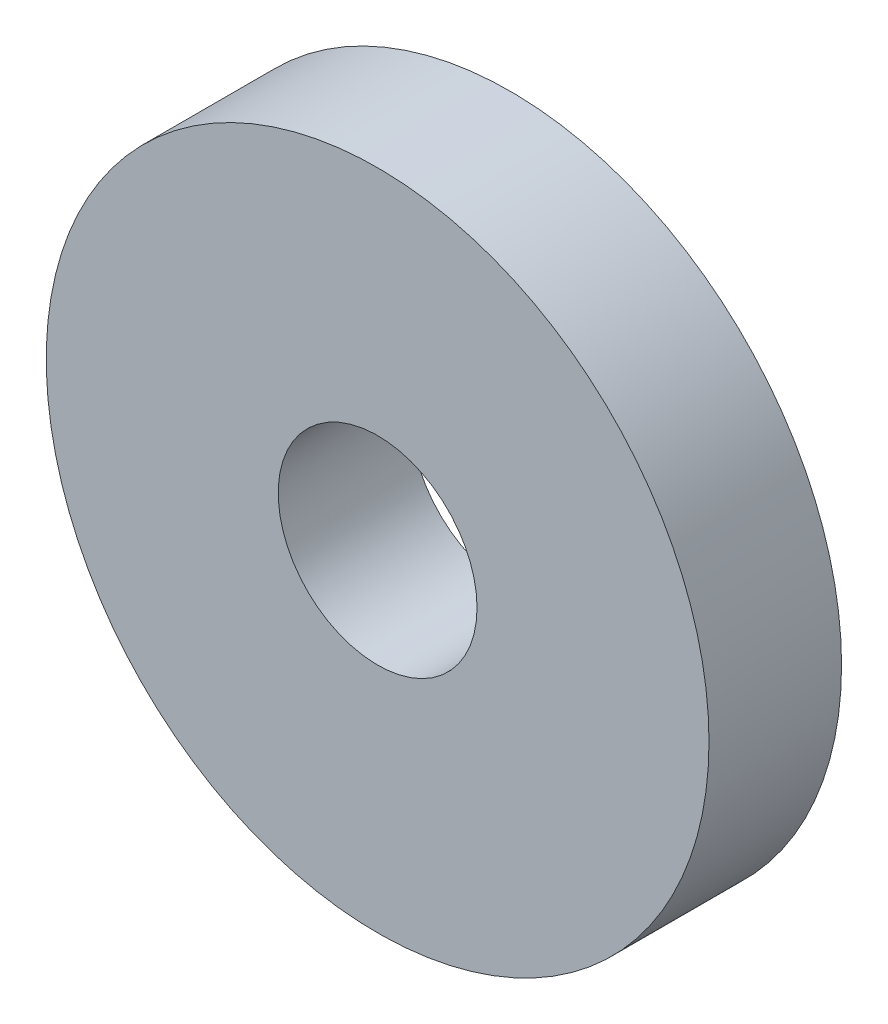
ISO-10303-21;
HEADER;
FILE_DESCRIPTION(('STEP AP214'),'2;1');
FILE_NAME('part.step','',(''),(''),'','','');
FILE_SCHEMA(('AUTOMOTIVE_DESIGN { 1 0 10303 214 1 1 1 1 }'));
ENDSEC;
DATA;
#1=APPLICATION_CONTEXT('core data for automotive mechanical design processes');
#2=APPLICATION_PROTOCOL_DEFINITION('international standard','automotive_design',2000,#1);
#3=PRODUCT_CONTEXT('',#1,'mechanical');
#4=PRODUCT('Part','Part','',(#3));
#5=PRODUCT_RELATED_PRODUCT_CATEGORY('part','',(#4));
#6=PRODUCT_DEFINITION_FORMATION('','',#4);
#7=PRODUCT_DEFINITION_CONTEXT('part definition',#1,'design');
#8=PRODUCT_DEFINITION('design','',#6,#7);
#9=PRODUCT_DEFINITION_SHAPE('','',#8);
#10=(LENGTH_UNIT() NAMED_UNIT(*) SI_UNIT(.MILLI.,.METRE.));
#11=(NAMED_UNIT(*) PLANE_ANGLE_UNIT() SI_UNIT($,.RADIAN.));
#12=(NAMED_UNIT(*) SI_UNIT($,.STERADIAN.) SOLID_ANGLE_UNIT());
#13=UNCERTAINTY_MEASURE_WITH_UNIT(LENGTH_MEASURE(1.E-05),#10,'distance_accuracy_value','');
#14=(GEOMETRIC_REPRESENTATION_CONTEXT(3) GLOBAL_UNCERTAINTY_ASSIGNED_CONTEXT((#13)) GLOBAL_UNIT_ASSIGNED_CONTEXT((#10,
#11,#12)) REPRESENTATION_CONTEXT('',''));
#15=CARTESIAN_POINT('',(0.,0.,0.));
#16=DIRECTION('',(0.,0.,1.));
#17=DIRECTION('',(1.,0.,0.));
#18=AXIS2_PLACEMENT_3D('',#15,#16,#17);
#19=CARTESIAN_POINT('',(0.,0.,0.));
#20=DIRECTION('',(0.,0.,1.));
#21=DIRECTION('',(1.,0.,0.));
#22=AXIS2_PLACEMENT_3D('',#19,#20,#21);
#23=CYLINDRICAL_SURFACE('',#22,10.);
#24=CARTESIAN_POINT('',(0.,0.,0.));
#25=DIRECTION('',(0.,0.,1.));
#26=DIRECTION('',(1.,0.,0.));
#27=AXIS2_PLACEMENT_3D('',#24,#25,#26);
#28=CIRCLE('',#27,10.);
#29=CARTESIAN_POINT('',(10.,0.,0.));
#30=VERTEX_POINT('',#29);
#31=EDGE_CURVE('E47',#30,#30,#28,.T.);
#32=ORIENTED_EDGE('',*,*,#31,.F.);
#33=EDGE_LOOP('',(#32));
#34=FACE_BOUND('',#33,.T.);
#35=CARTESIAN_POINT('',(0.,0.,-4.));
#36=DIRECTION('',(0.,0.,1.));
#37=DIRECTION('',(1.,0.,0.));
#38=AXIS2_PLACEMENT_3D('',#35,#36,#37);
#39=CIRCLE('',#38,10.);
#40=CARTESIAN_POINT('',(10.,0.,-4.));
#41=VERTEX_POINT('',#40);
#42=EDGE_CURVE('E10',#41,#41,#39,.T.);
#43=ORIENTED_EDGE('',*,*,#42,.T.);
#44=EDGE_LOOP('',(#43));
#45=FACE_BOUND('',#44,.T.);
#46=ADVANCED_FACE('F33',(#34,#45),#23,.T.);
#47=CARTESIAN_POINT('',(0.,10.,-4.));
#48=DIRECTION('',(0.,0.,1.));
#49=DIRECTION('',(1.,0.,0.));
#50=AXIS2_PLACEMENT_3D('',#47,#48,#49);
#51=PLANE('',#50);
#52=ORIENTED_EDGE('',*,*,#42,.F.);
#53=EDGE_LOOP('',(#52));
#54=FACE_BOUND('',#53,.T.);
#55=CARTESIAN_POINT('',(0.,0.,-4.));
#56=DIRECTION('',(0.,0.,1.));
#57=DIRECTION('',(1.,0.,0.));
#58=AXIS2_PLACEMENT_3D('',#55,#56,#57);
#59=CIRCLE('',#58,3.);
#60=CARTESIAN_POINT('',(3.,0.,-4.));
#61=VERTEX_POINT('',#60);
#62=EDGE_CURVE('E39',#61,#61,#59,.T.);
#63=ORIENTED_EDGE('',*,*,#62,.T.);
#64=EDGE_LOOP('',(#63));
#65=FACE_BOUND('',#64,.T.);
#66=ADVANCED_FACE('F56',(#54,#65),#51,.F.);
#67=CARTESIAN_POINT('',(0.,0.,0.));
#68=DIRECTION('',(0.,0.,1.));
#69=DIRECTION('',(1.,0.,0.));
#70=AXIS2_PLACEMENT_3D('',#67,#68,#69);
#71=CYLINDRICAL_SURFACE('',#70,3.);
#72=ORIENTED_EDGE('',*,*,#62,.F.);
#73=EDGE_LOOP('',(#72));
#74=FACE_BOUND('',#73,.T.);
#75=CARTESIAN_POINT('',(0.,0.,0.));
#76=DIRECTION('',(0.,0.,1.));
#77=DIRECTION('',(1.,0.,0.));
#78=AXIS2_PLACEMENT_3D('',#75,#76,#77);
#79=CIRCLE('',#78,3.);
#80=CARTESIAN_POINT('',(3.,0.,0.));
#81=VERTEX_POINT('',#80);
#82=EDGE_CURVE('E43',#81,#81,#79,.T.);
#83=ORIENTED_EDGE('',*,*,#82,.T.);
#84=EDGE_LOOP('',(#83));
#85=FACE_BOUND('',#84,.T.);
#86=ADVANCED_FACE('F60',(#74,#85),#71,.F.);
#87=CARTESIAN_POINT('',(0.,3.,0.));
#88=DIRECTION('',(0.,0.,-1.));
#89=DIRECTION('',(-1.,0.,0.));
#90=AXIS2_PLACEMENT_3D('',#87,#88,#89);
#91=PLANE('',#90);
#92=ORIENTED_EDGE('',*,*,#82,.F.);
#93=EDGE_LOOP('',(#92));
#94=FACE_BOUND('',#93,.T.);
#95=ORIENTED_EDGE('',*,*,#31,.T.);
#96=EDGE_LOOP('',(#95));
#97=FACE_BOUND('',#96,.T.);
#98=ADVANCED_FACE('F53',(#94,#97),#91,.F.);
#99=CLOSED_SHELL('',(#46,#66,#86,#98));
#100=MANIFOLD_SOLID_BREP('B2',#99);
#101=ADVANCED_BREP_SHAPE_REPRESENTATION('',(#18,#100),#14);
#102=SHAPE_DEFINITION_REPRESENTATION(#9,#101);
ENDSEC;
END-ISO-10303-21;
